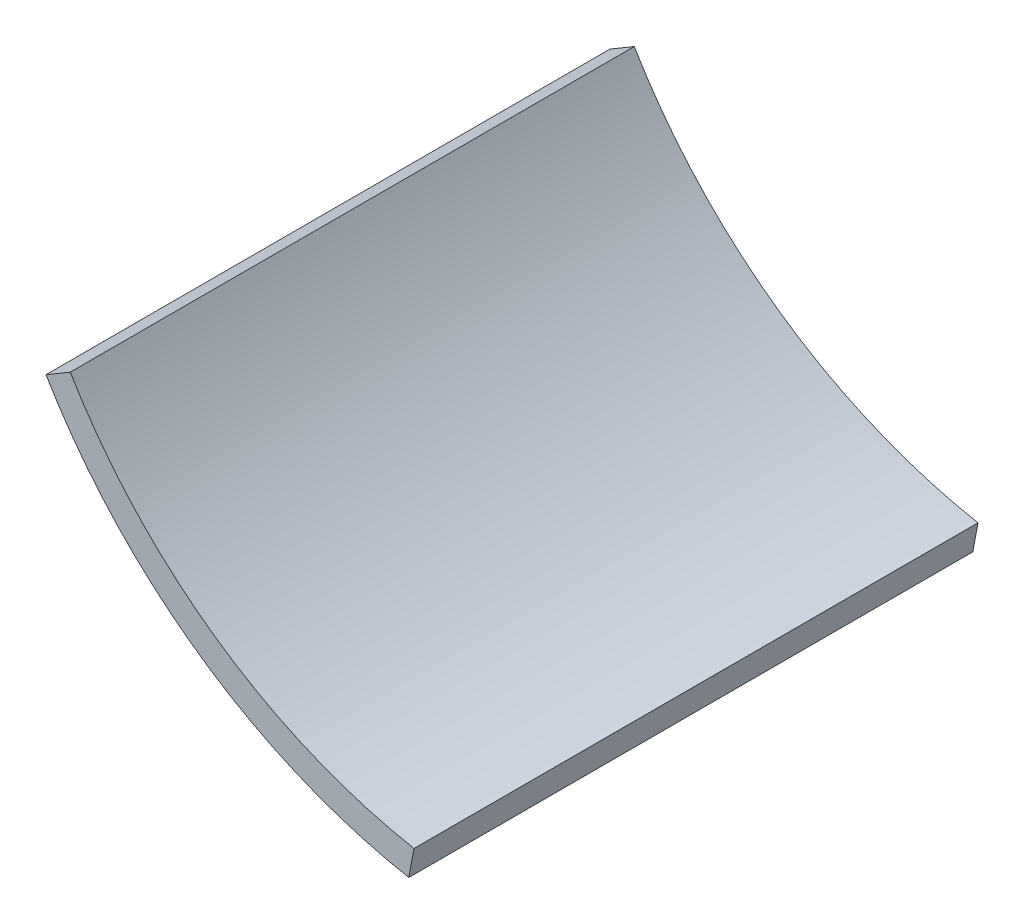
ISO-10303-21;
HEADER;
FILE_DESCRIPTION(('STEP AP214'),'2;1');
FILE_NAME('part.step','',(''),(''),'','','');
FILE_SCHEMA(('AUTOMOTIVE_DESIGN { 1 0 10303 214 1 1 1 1 }'));
ENDSEC;
DATA;
#1=APPLICATION_CONTEXT('core data for automotive mechanical design processes');
#2=APPLICATION_PROTOCOL_DEFINITION('international standard','automotive_design',2000,#1);
#3=PRODUCT_CONTEXT('',#1,'mechanical');
#4=PRODUCT('Part','Part','',(#3));
#5=PRODUCT_RELATED_PRODUCT_CATEGORY('part','',(#4));
#6=PRODUCT_DEFINITION_FORMATION('','',#4);
#7=PRODUCT_DEFINITION_CONTEXT('part definition',#1,'design');
#8=PRODUCT_DEFINITION('design','',#6,#7);
#9=PRODUCT_DEFINITION_SHAPE('','',#8);
#10=(LENGTH_UNIT() NAMED_UNIT(*) SI_UNIT(.MILLI.,.METRE.));
#11=(NAMED_UNIT(*) PLANE_ANGLE_UNIT() SI_UNIT($,.RADIAN.));
#12=(NAMED_UNIT(*) SI_UNIT($,.STERADIAN.) SOLID_ANGLE_UNIT());
#13=UNCERTAINTY_MEASURE_WITH_UNIT(LENGTH_MEASURE(1.E-05),#10,'distance_accuracy_value','');
#14=(GEOMETRIC_REPRESENTATION_CONTEXT(3) GLOBAL_UNCERTAINTY_ASSIGNED_CONTEXT((#13)) GLOBAL_UNIT_ASSIGNED_CONTEXT((#10,
#11,#12)) REPRESENTATION_CONTEXT('',''));
#15=CARTESIAN_POINT('',(0.,0.,0.));
#16=DIRECTION('',(0.,0.,1.));
#17=DIRECTION('',(1.,0.,0.));
#18=AXIS2_PLACEMENT_3D('',#15,#16,#17);
#19=CARTESIAN_POINT('',(0.,0.,63.5));
#20=DIRECTION('',(0.,0.,1.));
#21=DIRECTION('',(1.,0.,0.));
#22=AXIS2_PLACEMENT_3D('',#19,#20,#21);
#23=PLANE('',#22);
#24=DIRECTION('',(-0.183683573112545,-0.982985424596219,0.));
#25=VECTOR('',#24,1.);
#26=CARTESIAN_POINT('',(-23.6883486030292,-126.768556463483,63.5));
#27=LINE('',#26,#25);
#28=CARTESIAN_POINT('',(-20.9950324067638,-112.355234031348,63.5));
#29=VERTEX_POINT('',#28);
#30=CARTESIAN_POINT('',(-22.1614230960285,-118.597191477534,63.5));
#31=VERTEX_POINT('',#30);
#32=EDGE_CURVE('E90',#29,#31,#27,.T.);
#33=ORIENTED_EDGE('',*,*,#32,.F.);
#34=CARTESIAN_POINT('',(0.,0.,63.5));
#35=DIRECTION('',(0.,0.,1.));
#36=DIRECTION('',(1.,0.,0.));
#37=AXIS2_PLACEMENT_3D('',#34,#35,#36);
#38=CIRCLE('',#37,114.3);
#39=CARTESIAN_POINT('',(-98.392525089636,-58.1670096058355,63.5));
#40=VERTEX_POINT('',#39);
#41=EDGE_CURVE('E89',#40,#29,#38,.T.);
#42=ORIENTED_EDGE('',*,*,#41,.F.);
#43=DIRECTION('',(0.860826991160419,0.508897721835831,0.));
#44=VECTOR('',#43,1.);
#45=CARTESIAN_POINT('',(0.,0.,63.5));
#46=LINE('',#45,#44);
#47=CARTESIAN_POINT('',(-103.858776483505,-61.3985101394931,63.5));
#48=VERTEX_POINT('',#47);
#49=EDGE_CURVE('E57',#48,#40,#46,.T.);
#50=ORIENTED_EDGE('',*,*,#49,.F.);
#51=CARTESIAN_POINT('',(0.,0.,63.5));
#52=DIRECTION('',(0.,0.,1.));
#53=DIRECTION('',(1.,0.,0.));
#54=AXIS2_PLACEMENT_3D('',#51,#52,#53);
#55=CIRCLE('',#54,120.65);
#56=EDGE_CURVE('E87',#48,#31,#55,.T.);
#57=ORIENTED_EDGE('',*,*,#56,.T.);
#58=EDGE_LOOP('',(#33,#42,#50,#57));
#59=FACE_BOUND('',#58,.T.);
#60=ADVANCED_FACE('F35',(#59),#23,.T.);
#61=CARTESIAN_POINT('',(0.,0.,-63.5));
#62=DIRECTION('',(0.,0.,1.));
#63=DIRECTION('',(1.,0.,0.));
#64=AXIS2_PLACEMENT_3D('',#61,#62,#63);
#65=PLANE('',#64);
#66=CARTESIAN_POINT('',(0.,0.,-63.5));
#67=DIRECTION('',(0.,0.,1.));
#68=DIRECTION('',(1.,0.,0.));
#69=AXIS2_PLACEMENT_3D('',#66,#67,#68);
#70=CIRCLE('',#69,114.3);
#71=CARTESIAN_POINT('',(-98.392525089636,-58.1670096058355,-63.5));
#72=VERTEX_POINT('',#71);
#73=CARTESIAN_POINT('',(-20.9950324067638,-112.355234031348,-63.5));
#74=VERTEX_POINT('',#73);
#75=EDGE_CURVE('E97',#72,#74,#70,.T.);
#76=ORIENTED_EDGE('',*,*,#75,.T.);
#77=DIRECTION('',(-0.183683573112545,-0.982985424596219,0.));
#78=VECTOR('',#77,1.);
#79=CARTESIAN_POINT('',(-23.6883486030292,-126.768556463483,-63.5));
#80=LINE('',#79,#78);
#81=CARTESIAN_POINT('',(-22.1614230960285,-118.597191477534,-63.5));
#82=VERTEX_POINT('',#81);
#83=EDGE_CURVE('E49',#74,#82,#80,.T.);
#84=ORIENTED_EDGE('',*,*,#83,.T.);
#85=CARTESIAN_POINT('',(0.,0.,-63.5));
#86=DIRECTION('',(0.,0.,1.));
#87=DIRECTION('',(1.,0.,0.));
#88=AXIS2_PLACEMENT_3D('',#85,#86,#87);
#89=CIRCLE('',#88,120.65);
#90=CARTESIAN_POINT('',(-103.858776483505,-61.3985101394931,-63.5));
#91=VERTEX_POINT('',#90);
#92=EDGE_CURVE('E93',#91,#82,#89,.T.);
#93=ORIENTED_EDGE('',*,*,#92,.F.);
#94=DIRECTION('',(0.860826991160419,0.508897721835831,0.));
#95=VECTOR('',#94,1.);
#96=CARTESIAN_POINT('',(0.,0.,-63.5));
#97=LINE('',#96,#95);
#98=EDGE_CURVE('E76',#91,#72,#97,.T.);
#99=ORIENTED_EDGE('',*,*,#98,.T.);
#100=EDGE_LOOP('',(#76,#84,#93,#99));
#101=FACE_BOUND('',#100,.T.);
#102=ADVANCED_FACE('F106',(#101),#65,.F.);
#103=CARTESIAN_POINT('',(0.,0.,63.5));
#104=DIRECTION('',(0.,0.,-1.));
#105=DIRECTION('',(-1.,0.,0.));
#106=AXIS2_PLACEMENT_3D('',#103,#104,#105);
#107=CYLINDRICAL_SURFACE('',#106,120.65);
#108=ORIENTED_EDGE('',*,*,#92,.T.);
#109=DIRECTION('',(0.,0.,-1.));
#110=VECTOR('',#109,1.);
#111=CARTESIAN_POINT('',(-22.1614230960285,-118.597191477534,63.5));
#112=LINE('',#111,#110);
#113=EDGE_CURVE('E81',#82,#31,#112,.F.);
#114=ORIENTED_EDGE('',*,*,#113,.T.);
#115=ORIENTED_EDGE('',*,*,#56,.F.);
#116=DIRECTION('',(0.,0.,-1.));
#117=VECTOR('',#116,1.);
#118=CARTESIAN_POINT('',(-103.858776483505,-61.3985101394931,63.5));
#119=LINE('',#118,#117);
#120=EDGE_CURVE('E73',#48,#91,#119,.T.);
#121=ORIENTED_EDGE('',*,*,#120,.T.);
#122=EDGE_LOOP('',(#108,#114,#115,#121));
#123=FACE_BOUND('',#122,.T.);
#124=ADVANCED_FACE('F37',(#123),#107,.T.);
#125=CARTESIAN_POINT('',(0.,0.,63.5));
#126=DIRECTION('',(0.,0.,-1.));
#127=DIRECTION('',(-1.,0.,0.));
#128=AXIS2_PLACEMENT_3D('',#125,#126,#127);
#129=CYLINDRICAL_SURFACE('',#128,114.3);
#130=DIRECTION('',(0.,0.,-1.));
#131=VECTOR('',#130,1.);
#132=CARTESIAN_POINT('',(-20.9950324067638,-112.355234031348,63.5));
#133=LINE('',#132,#131);
#134=EDGE_CURVE('E11',#74,#29,#133,.F.);
#135=ORIENTED_EDGE('',*,*,#134,.F.);
#136=ORIENTED_EDGE('',*,*,#75,.F.);
#137=DIRECTION('',(0.,0.,-1.));
#138=VECTOR('',#137,1.);
#139=CARTESIAN_POINT('',(-98.392525089636,-58.1670096058355,63.5));
#140=LINE('',#139,#138);
#141=EDGE_CURVE('E43',#40,#72,#140,.T.);
#142=ORIENTED_EDGE('',*,*,#141,.F.);
#143=ORIENTED_EDGE('',*,*,#41,.T.);
#144=EDGE_LOOP('',(#135,#136,#142,#143));
#145=FACE_BOUND('',#144,.T.);
#146=ADVANCED_FACE('F108',(#145),#129,.F.);
#147=CARTESIAN_POINT('',(0.,0.,-63.5));
#148=DIRECTION('',(0.508897721835831,-0.860826991160419,0.));
#149=DIRECTION('',(0.860826991160419,0.508897721835831,0.));
#150=AXIS2_PLACEMENT_3D('',#147,#148,#149);
#151=PLANE('',#150);
#152=ORIENTED_EDGE('',*,*,#49,.T.);
#153=ORIENTED_EDGE('',*,*,#141,.T.);
#154=ORIENTED_EDGE('',*,*,#98,.F.);
#155=ORIENTED_EDGE('',*,*,#120,.F.);
#156=EDGE_LOOP('',(#152,#153,#154,#155));
#157=FACE_BOUND('',#156,.T.);
#158=ADVANCED_FACE('F74',(#157),#151,.F.);
#159=CARTESIAN_POINT('',(-23.6883486030292,-126.768556463483,-63.5));
#160=DIRECTION('',(-0.982985424596219,0.183683573112545,0.));
#161=DIRECTION('',(-0.183683573112545,-0.982985424596219,0.));
#162=AXIS2_PLACEMENT_3D('',#159,#160,#161);
#163=PLANE('',#162);
#164=ORIENTED_EDGE('',*,*,#83,.F.);
#165=ORIENTED_EDGE('',*,*,#134,.T.);
#166=ORIENTED_EDGE('',*,*,#32,.T.);
#167=ORIENTED_EDGE('',*,*,#113,.F.);
#168=EDGE_LOOP('',(#164,#165,#166,#167));
#169=FACE_BOUND('',#168,.T.);
#170=ADVANCED_FACE('F109',(#169),#163,.F.);
#171=CLOSED_SHELL('',(#60,#102,#124,#146,#158,#170));
#172=MANIFOLD_SOLID_BREP('B2',#171);
#173=ADVANCED_BREP_SHAPE_REPRESENTATION('',(#18,#172),#14);
#174=SHAPE_DEFINITION_REPRESENTATION(#9,#173);
ENDSEC;
END-ISO-10303-21;
